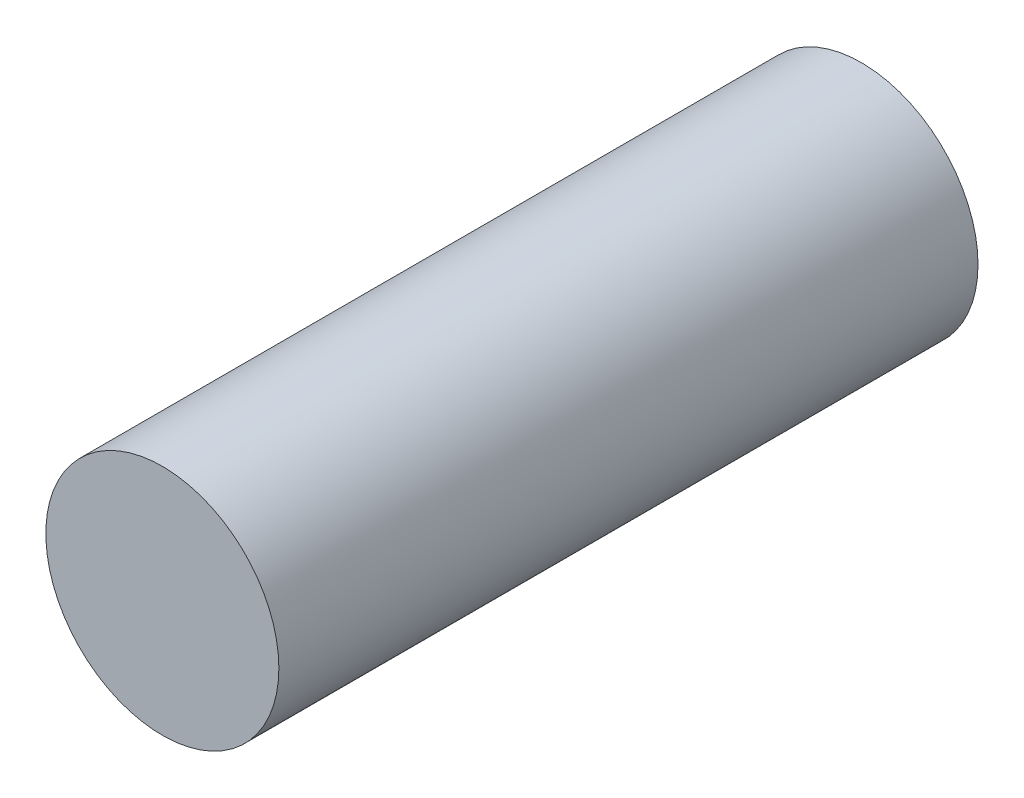
ISO-10303-21;
HEADER;
FILE_DESCRIPTION(('STEP AP214'),'2;1');
FILE_NAME('part.step','',(''),(''),'','','');
FILE_SCHEMA(('AUTOMOTIVE_DESIGN { 1 0 10303 214 1 1 1 1 }'));
ENDSEC;
DATA;
#1=APPLICATION_CONTEXT('core data for automotive mechanical design processes');
#2=APPLICATION_PROTOCOL_DEFINITION('international standard','automotive_design',2000,#1);
#3=PRODUCT_CONTEXT('',#1,'mechanical');
#4=PRODUCT('Part','Part','',(#3));
#5=PRODUCT_RELATED_PRODUCT_CATEGORY('part','',(#4));
#6=PRODUCT_DEFINITION_FORMATION('','',#4);
#7=PRODUCT_DEFINITION_CONTEXT('part definition',#1,'design');
#8=PRODUCT_DEFINITION('design','',#6,#7);
#9=PRODUCT_DEFINITION_SHAPE('','',#8);
#10=(LENGTH_UNIT() NAMED_UNIT(*) SI_UNIT(.MILLI.,.METRE.));
#11=(NAMED_UNIT(*) PLANE_ANGLE_UNIT() SI_UNIT($,.RADIAN.));
#12=(NAMED_UNIT(*) SI_UNIT($,.STERADIAN.) SOLID_ANGLE_UNIT());
#13=UNCERTAINTY_MEASURE_WITH_UNIT(LENGTH_MEASURE(1.E-05),#10,'distance_accuracy_value','');
#14=(GEOMETRIC_REPRESENTATION_CONTEXT(3) GLOBAL_UNCERTAINTY_ASSIGNED_CONTEXT((#13)) GLOBAL_UNIT_ASSIGNED_CONTEXT((#10,
#11,#12)) REPRESENTATION_CONTEXT('',''));
#15=CARTESIAN_POINT('',(0.,0.,0.));
#16=DIRECTION('',(0.,0.,1.));
#17=DIRECTION('',(1.,0.,0.));
#18=AXIS2_PLACEMENT_3D('',#15,#16,#17);
#19=CARTESIAN_POINT('',(0.,0.,30.));
#20=DIRECTION('',(0.,0.,-1.));
#21=DIRECTION('',(-1.,0.,0.));
#22=AXIS2_PLACEMENT_3D('',#19,#20,#21);
#23=CYLINDRICAL_SURFACE('',#22,5.);
#24=CARTESIAN_POINT('',(0.,0.,30.));
#25=DIRECTION('',(0.,0.,1.));
#26=DIRECTION('',(1.,0.,0.));
#27=AXIS2_PLACEMENT_3D('',#24,#25,#26);
#28=CIRCLE('',#27,5.);
#29=CARTESIAN_POINT('',(5.,0.,30.));
#30=VERTEX_POINT('',#29);
#31=EDGE_CURVE('E10',#30,#30,#28,.T.);
#32=ORIENTED_EDGE('',*,*,#31,.F.);
#33=EDGE_LOOP('',(#32));
#34=FACE_BOUND('',#33,.T.);
#35=CARTESIAN_POINT('',(0.,0.,0.));
#36=DIRECTION('',(0.,0.,1.));
#37=DIRECTION('',(1.,0.,0.));
#38=AXIS2_PLACEMENT_3D('',#35,#36,#37);
#39=CIRCLE('',#38,5.);
#40=CARTESIAN_POINT('',(5.,0.,0.));
#41=VERTEX_POINT('',#40);
#42=EDGE_CURVE('E35',#41,#41,#39,.T.);
#43=ORIENTED_EDGE('',*,*,#42,.T.);
#44=EDGE_LOOP('',(#43));
#45=FACE_BOUND('',#44,.T.);
#46=ADVANCED_FACE('F32',(#34,#45),#23,.T.);
#47=CARTESIAN_POINT('',(0.,0.,30.));
#48=DIRECTION('',(0.,0.,1.));
#49=DIRECTION('',(1.,0.,0.));
#50=AXIS2_PLACEMENT_3D('',#47,#48,#49);
#51=PLANE('',#50);
#52=ORIENTED_EDGE('',*,*,#31,.T.);
#53=EDGE_LOOP('',(#52));
#54=FACE_BOUND('',#53,.T.);
#55=ADVANCED_FACE('F47',(#54),#51,.T.);
#56=CARTESIAN_POINT('',(0.,0.,0.));
#57=DIRECTION('',(0.,0.,1.));
#58=DIRECTION('',(1.,0.,0.));
#59=AXIS2_PLACEMENT_3D('',#56,#57,#58);
#60=PLANE('',#59);
#61=ORIENTED_EDGE('',*,*,#42,.F.);
#62=EDGE_LOOP('',(#61));
#63=FACE_BOUND('',#62,.T.);
#64=ADVANCED_FACE('F45',(#63),#60,.F.);
#65=CLOSED_SHELL('',(#46,#55,#64));
#66=MANIFOLD_SOLID_BREP('B2',#65);
#67=ADVANCED_BREP_SHAPE_REPRESENTATION('',(#18,#66),#14);
#68=SHAPE_DEFINITION_REPRESENTATION(#9,#67);
ENDSEC;
END-ISO-10303-21;
